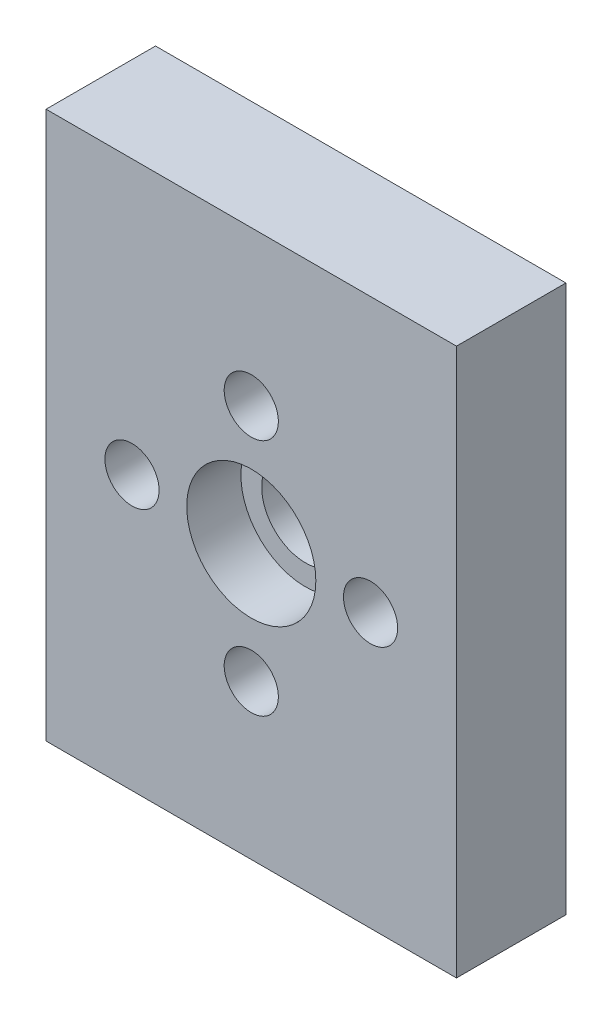
ISO-10303-21;
HEADER;
FILE_DESCRIPTION(('STEP AP214'),'2;1');
FILE_NAME('part.step','',(''),(''),'','','');
FILE_SCHEMA(('AUTOMOTIVE_DESIGN { 1 0 10303 214 1 1 1 1 }'));
ENDSEC;
DATA;
#1=APPLICATION_CONTEXT('core data for automotive mechanical design processes');
#2=APPLICATION_PROTOCOL_DEFINITION('international standard','automotive_design',2000,#1);
#3=PRODUCT_CONTEXT('',#1,'mechanical');
#4=PRODUCT('Part','Part','',(#3));
#5=PRODUCT_RELATED_PRODUCT_CATEGORY('part','',(#4));
#6=PRODUCT_DEFINITION_FORMATION('','',#4);
#7=PRODUCT_DEFINITION_CONTEXT('part definition',#1,'design');
#8=PRODUCT_DEFINITION('design','',#6,#7);
#9=PRODUCT_DEFINITION_SHAPE('','',#8);
#10=(LENGTH_UNIT() NAMED_UNIT(*) SI_UNIT(.MILLI.,.METRE.));
#11=(NAMED_UNIT(*) PLANE_ANGLE_UNIT() SI_UNIT($,.RADIAN.));
#12=(NAMED_UNIT(*) SI_UNIT($,.STERADIAN.) SOLID_ANGLE_UNIT());
#13=UNCERTAINTY_MEASURE_WITH_UNIT(LENGTH_MEASURE(1.E-05),#10,'distance_accuracy_value','');
#14=(GEOMETRIC_REPRESENTATION_CONTEXT(3) GLOBAL_UNCERTAINTY_ASSIGNED_CONTEXT((#13)) GLOBAL_UNIT_ASSIGNED_CONTEXT((#10,
#11,#12)) REPRESENTATION_CONTEXT('',''));
#15=CARTESIAN_POINT('',(0.,0.,0.));
#16=DIRECTION('',(0.,0.,1.));
#17=DIRECTION('',(1.,0.,0.));
#18=AXIS2_PLACEMENT_3D('',#15,#16,#17);
#19=CARTESIAN_POINT('',(9.525,-12.7,5.08));
#20=DIRECTION('',(-1.,0.,0.));
#21=DIRECTION('',(0.,0.,1.));
#22=AXIS2_PLACEMENT_3D('',#19,#20,#21);
#23=PLANE('',#22);
#24=DIRECTION('',(0.,1.,0.));
#25=VECTOR('',#24,1.);
#26=CARTESIAN_POINT('',(9.525,-12.7,0.));
#27=LINE('',#26,#25);
#28=CARTESIAN_POINT('',(9.525,-12.7,0.));
#29=VERTEX_POINT('',#28);
#30=CARTESIAN_POINT('',(9.525,12.7,0.));
#31=VERTEX_POINT('',#30);
#32=EDGE_CURVE('E96',#29,#31,#27,.T.);
#33=ORIENTED_EDGE('',*,*,#32,.T.);
#34=DIRECTION('',(0.,0.,-1.));
#35=VECTOR('',#34,1.);
#36=CARTESIAN_POINT('',(9.525,12.7,5.08));
#37=LINE('',#36,#35);
#38=CARTESIAN_POINT('',(9.525,12.7,5.08));
#39=VERTEX_POINT('',#38);
#40=EDGE_CURVE('E11',#39,#31,#37,.T.);
#41=ORIENTED_EDGE('',*,*,#40,.F.);
#42=DIRECTION('',(0.,1.,0.));
#43=VECTOR('',#42,1.);
#44=CARTESIAN_POINT('',(9.525,-12.7,5.08));
#45=LINE('',#44,#43);
#46=CARTESIAN_POINT('',(9.525,-12.7,5.08));
#47=VERTEX_POINT('',#46);
#48=EDGE_CURVE('E84',#47,#39,#45,.T.);
#49=ORIENTED_EDGE('',*,*,#48,.F.);
#50=DIRECTION('',(0.,0.,-1.));
#51=VECTOR('',#50,1.);
#52=CARTESIAN_POINT('',(9.525,-12.7,5.08));
#53=LINE('',#52,#51);
#54=EDGE_CURVE('E92',#47,#29,#53,.T.);
#55=ORIENTED_EDGE('',*,*,#54,.T.);
#56=EDGE_LOOP('',(#33,#41,#49,#55));
#57=FACE_BOUND('',#56,.T.);
#58=ADVANCED_FACE('F33',(#57),#23,.F.);
#59=CARTESIAN_POINT('',(-9.525,12.7,5.08));
#60=DIRECTION('',(0.,-1.,0.));
#61=DIRECTION('',(0.,0.,-1.));
#62=AXIS2_PLACEMENT_3D('',#59,#60,#61);
#63=PLANE('',#62);
#64=DIRECTION('',(-1.,0.,0.));
#65=VECTOR('',#64,1.);
#66=CARTESIAN_POINT('',(-9.525,12.7,0.));
#67=LINE('',#66,#65);
#68=CARTESIAN_POINT('',(-9.525,12.7,0.));
#69=VERTEX_POINT('',#68);
#70=EDGE_CURVE('E88',#31,#69,#67,.T.);
#71=ORIENTED_EDGE('',*,*,#70,.T.);
#72=DIRECTION('',(0.,0.,-1.));
#73=VECTOR('',#72,1.);
#74=CARTESIAN_POINT('',(-9.525,12.7,5.08));
#75=LINE('',#74,#73);
#76=CARTESIAN_POINT('',(-9.525,12.7,5.08));
#77=VERTEX_POINT('',#76);
#78=EDGE_CURVE('E41',#77,#69,#75,.T.);
#79=ORIENTED_EDGE('',*,*,#78,.F.);
#80=DIRECTION('',(-1.,0.,0.));
#81=VECTOR('',#80,1.);
#82=CARTESIAN_POINT('',(-9.525,12.7,5.08));
#83=LINE('',#82,#81);
#84=EDGE_CURVE('E79',#39,#77,#83,.T.);
#85=ORIENTED_EDGE('',*,*,#84,.F.);
#86=ORIENTED_EDGE('',*,*,#40,.T.);
#87=EDGE_LOOP('',(#71,#79,#85,#86));
#88=FACE_BOUND('',#87,.T.);
#89=ADVANCED_FACE('F87',(#88),#63,.F.);
#90=CARTESIAN_POINT('',(-9.525,-12.7,5.08));
#91=DIRECTION('',(1.,0.,0.));
#92=DIRECTION('',(0.,0.,-1.));
#93=AXIS2_PLACEMENT_3D('',#90,#91,#92);
#94=PLANE('',#93);
#95=DIRECTION('',(0.,-1.,0.));
#96=VECTOR('',#95,1.);
#97=CARTESIAN_POINT('',(-9.525,-12.7,0.));
#98=LINE('',#97,#96);
#99=CARTESIAN_POINT('',(-9.525,-12.7,0.));
#100=VERTEX_POINT('',#99);
#101=EDGE_CURVE('E66',#69,#100,#98,.T.);
#102=ORIENTED_EDGE('',*,*,#101,.T.);
#103=DIRECTION('',(0.,0.,-1.));
#104=VECTOR('',#103,1.);
#105=CARTESIAN_POINT('',(-9.525,-12.7,5.08));
#106=LINE('',#105,#104);
#107=CARTESIAN_POINT('',(-9.525,-12.7,5.08));
#108=VERTEX_POINT('',#107);
#109=EDGE_CURVE('E89',#108,#100,#106,.T.);
#110=ORIENTED_EDGE('',*,*,#109,.F.);
#111=DIRECTION('',(0.,-1.,0.));
#112=VECTOR('',#111,1.);
#113=CARTESIAN_POINT('',(-9.525,-12.7,5.08));
#114=LINE('',#113,#112);
#115=EDGE_CURVE('E82',#77,#108,#114,.T.);
#116=ORIENTED_EDGE('',*,*,#115,.F.);
#117=ORIENTED_EDGE('',*,*,#78,.T.);
#118=EDGE_LOOP('',(#102,#110,#116,#117));
#119=FACE_BOUND('',#118,.T.);
#120=ADVANCED_FACE('F90',(#119),#94,.F.);
#121=CARTESIAN_POINT('',(-9.525,-12.7,5.08));
#122=DIRECTION('',(0.,1.,0.));
#123=DIRECTION('',(0.,0.,1.));
#124=AXIS2_PLACEMENT_3D('',#121,#122,#123);
#125=PLANE('',#124);
#126=DIRECTION('',(1.,0.,0.));
#127=VECTOR('',#126,1.);
#128=CARTESIAN_POINT('',(-9.525,-12.7,0.));
#129=LINE('',#128,#127);
#130=EDGE_CURVE('E72',#100,#29,#129,.T.);
#131=ORIENTED_EDGE('',*,*,#130,.T.);
#132=ORIENTED_EDGE('',*,*,#54,.F.);
#133=DIRECTION('',(1.,0.,0.));
#134=VECTOR('',#133,1.);
#135=CARTESIAN_POINT('',(-9.525,-12.7,5.08));
#136=LINE('',#135,#134);
#137=EDGE_CURVE('E49',#108,#47,#136,.T.);
#138=ORIENTED_EDGE('',*,*,#137,.F.);
#139=ORIENTED_EDGE('',*,*,#109,.T.);
#140=EDGE_LOOP('',(#131,#132,#138,#139));
#141=FACE_BOUND('',#140,.T.);
#142=ADVANCED_FACE('F104',(#141),#125,.F.);
#143=CARTESIAN_POINT('',(0.,0.,5.08));
#144=DIRECTION('',(0.,0.,-1.));
#145=DIRECTION('',(-1.,0.,0.));
#146=AXIS2_PLACEMENT_3D('',#143,#144,#145);
#147=PLANE('',#146);
#148=CARTESIAN_POINT('',(-5.53719999999984,-1.57376689458033E-13,5.08));
#149=DIRECTION('',(0.,0.,1.));
#150=DIRECTION('',(1.,0.,0.));
#151=AXIS2_PLACEMENT_3D('',#148,#149,#150);
#152=CIRCLE('',#151,1.25730000000025);
#153=CARTESIAN_POINT('',(-4.27989999999959,-1.57376689458033E-13,5.08));
#154=VERTEX_POINT('',#153);
#155=EDGE_CURVE('E140',#154,#154,#152,.T.);
#156=ORIENTED_EDGE('',*,*,#155,.F.);
#157=EDGE_LOOP('',(#156));
#158=FACE_BOUND('',#157,.T.);
#159=CARTESIAN_POINT('',(3.13397156064818E-13,-5.5372,5.08));
#160=DIRECTION('',(0.,0.,1.));
#161=DIRECTION('',(1.,0.,0.));
#162=AXIS2_PLACEMENT_3D('',#159,#160,#161);
#163=CIRCLE('',#162,1.25730000000034);
#164=CARTESIAN_POINT('',(1.25730000000065,-5.5372,5.08));
#165=VERTEX_POINT('',#164);
#166=EDGE_CURVE('E134',#165,#165,#163,.T.);
#167=ORIENTED_EDGE('',*,*,#166,.F.);
#168=EDGE_LOOP('',(#167));
#169=FACE_BOUND('',#168,.T.);
#170=CARTESIAN_POINT('',(5.53720000000016,1.56698578032409E-13,5.08));
#171=DIRECTION('',(0.,0.,1.));
#172=DIRECTION('',(1.,0.,0.));
#173=AXIS2_PLACEMENT_3D('',#170,#171,#172);
#174=CIRCLE('',#173,1.25730000000012);
#175=CARTESIAN_POINT('',(6.79450000000028,1.56698578032409E-13,5.08));
#176=VERTEX_POINT('',#175);
#177=EDGE_CURVE('E128',#176,#176,#174,.T.);
#178=ORIENTED_EDGE('',*,*,#177,.F.);
#179=EDGE_LOOP('',(#178));
#180=FACE_BOUND('',#179,.T.);
#181=CARTESIAN_POINT('',(0.,5.5372,5.08));
#182=DIRECTION('',(0.,0.,1.));
#183=DIRECTION('',(1.,0.,0.));
#184=AXIS2_PLACEMENT_3D('',#181,#182,#183);
#185=CIRCLE('',#184,1.2573);
#186=CARTESIAN_POINT('',(1.2573,5.5372,5.08));
#187=VERTEX_POINT('',#186);
#188=EDGE_CURVE('E122',#187,#187,#185,.T.);
#189=ORIENTED_EDGE('',*,*,#188,.F.);
#190=EDGE_LOOP('',(#189));
#191=FACE_BOUND('',#190,.T.);
#192=CARTESIAN_POINT('',(0.,0.,5.08));
#193=DIRECTION('',(0.,0.,1.));
#194=DIRECTION('',(1.,0.,0.));
#195=AXIS2_PLACEMENT_3D('',#192,#193,#194);
#196=CIRCLE('',#195,2.9972);
#197=CARTESIAN_POINT('',(2.9972,0.,5.08));
#198=VERTEX_POINT('',#197);
#199=EDGE_CURVE('E110',#198,#198,#196,.T.);
#200=ORIENTED_EDGE('',*,*,#199,.F.);
#201=EDGE_LOOP('',(#200));
#202=FACE_BOUND('',#201,.T.);
#203=ORIENTED_EDGE('',*,*,#48,.T.);
#204=ORIENTED_EDGE('',*,*,#84,.T.);
#205=ORIENTED_EDGE('',*,*,#115,.T.);
#206=ORIENTED_EDGE('',*,*,#137,.T.);
#207=EDGE_LOOP('',(#203,#204,#205,#206));
#208=FACE_BOUND('',#207,.T.);
#209=ADVANCED_FACE('F80',(#158,#169,#180,#191,#202,#208),#147,.F.);
#210=CARTESIAN_POINT('',(0.,0.,0.));
#211=DIRECTION('',(0.,0.,-1.));
#212=DIRECTION('',(-1.,0.,0.));
#213=AXIS2_PLACEMENT_3D('',#210,#211,#212);
#214=PLANE('',#213);
#215=CARTESIAN_POINT('',(-5.53719999999984,-1.57376689458033E-13,0.));
#216=DIRECTION('',(0.,0.,1.));
#217=DIRECTION('',(1.,0.,0.));
#218=AXIS2_PLACEMENT_3D('',#215,#216,#217);
#219=CIRCLE('',#218,1.25730000000025);
#220=CARTESIAN_POINT('',(-4.27989999999959,-1.57376689458033E-13,0.));
#221=VERTEX_POINT('',#220);
#222=EDGE_CURVE('E137',#221,#221,#219,.T.);
#223=ORIENTED_EDGE('',*,*,#222,.T.);
#224=EDGE_LOOP('',(#223));
#225=FACE_BOUND('',#224,.T.);
#226=CARTESIAN_POINT('',(3.13397156064818E-13,-5.5372,0.));
#227=DIRECTION('',(0.,0.,1.));
#228=DIRECTION('',(1.,0.,0.));
#229=AXIS2_PLACEMENT_3D('',#226,#227,#228);
#230=CIRCLE('',#229,1.25730000000034);
#231=CARTESIAN_POINT('',(1.25730000000065,-5.5372,0.));
#232=VERTEX_POINT('',#231);
#233=EDGE_CURVE('E131',#232,#232,#230,.T.);
#234=ORIENTED_EDGE('',*,*,#233,.T.);
#235=EDGE_LOOP('',(#234));
#236=FACE_BOUND('',#235,.T.);
#237=CARTESIAN_POINT('',(5.53720000000016,1.56698578032409E-13,0.));
#238=DIRECTION('',(0.,0.,1.));
#239=DIRECTION('',(1.,0.,0.));
#240=AXIS2_PLACEMENT_3D('',#237,#238,#239);
#241=CIRCLE('',#240,1.25730000000012);
#242=CARTESIAN_POINT('',(6.79450000000028,1.56698578032409E-13,0.));
#243=VERTEX_POINT('',#242);
#244=EDGE_CURVE('E125',#243,#243,#241,.T.);
#245=ORIENTED_EDGE('',*,*,#244,.T.);
#246=EDGE_LOOP('',(#245));
#247=FACE_BOUND('',#246,.T.);
#248=CARTESIAN_POINT('',(0.,5.5372,0.));
#249=DIRECTION('',(0.,0.,1.));
#250=DIRECTION('',(1.,0.,0.));
#251=AXIS2_PLACEMENT_3D('',#248,#249,#250);
#252=CIRCLE('',#251,1.2573);
#253=CARTESIAN_POINT('',(1.2573,5.5372,0.));
#254=VERTEX_POINT('',#253);
#255=EDGE_CURVE('E119',#254,#254,#252,.T.);
#256=ORIENTED_EDGE('',*,*,#255,.T.);
#257=EDGE_LOOP('',(#256));
#258=FACE_BOUND('',#257,.T.);
#259=CARTESIAN_POINT('',(0.,0.,0.));
#260=DIRECTION('',(0.,0.,1.));
#261=DIRECTION('',(1.,0.,0.));
#262=AXIS2_PLACEMENT_3D('',#259,#260,#261);
#263=CIRCLE('',#262,2.032);
#264=CARTESIAN_POINT('',(2.032,0.,0.));
#265=VERTEX_POINT('',#264);
#266=EDGE_CURVE('E113',#265,#265,#263,.T.);
#267=ORIENTED_EDGE('',*,*,#266,.T.);
#268=EDGE_LOOP('',(#267));
#269=FACE_BOUND('',#268,.T.);
#270=ORIENTED_EDGE('',*,*,#32,.F.);
#271=ORIENTED_EDGE('',*,*,#130,.F.);
#272=ORIENTED_EDGE('',*,*,#101,.F.);
#273=ORIENTED_EDGE('',*,*,#70,.F.);
#274=EDGE_LOOP('',(#270,#271,#272,#273));
#275=FACE_BOUND('',#274,.T.);
#276=ADVANCED_FACE('F107',(#225,#236,#247,#258,#269,#275),#214,.T.);
#277=CARTESIAN_POINT('',(0.,0.,2.5654));
#278=DIRECTION('',(0.,0.,1.));
#279=DIRECTION('',(1.,0.,0.));
#280=AXIS2_PLACEMENT_3D('',#277,#278,#279);
#281=CYLINDRICAL_SURFACE('',#280,2.9972);
#282=CARTESIAN_POINT('',(0.,0.,2.5654));
#283=DIRECTION('',(0.,0.,1.));
#284=DIRECTION('',(1.,0.,0.));
#285=AXIS2_PLACEMENT_3D('',#282,#283,#284);
#286=CIRCLE('',#285,2.9972);
#287=CARTESIAN_POINT('',(2.9972,0.,2.5654));
#288=VERTEX_POINT('',#287);
#289=EDGE_CURVE('E99',#288,#288,#286,.T.);
#290=ORIENTED_EDGE('',*,*,#289,.F.);
#291=EDGE_LOOP('',(#290));
#292=FACE_BOUND('',#291,.T.);
#293=ORIENTED_EDGE('',*,*,#199,.T.);
#294=EDGE_LOOP('',(#293));
#295=FACE_BOUND('',#294,.T.);
#296=ADVANCED_FACE('F166',(#292,#295),#281,.F.);
#297=CARTESIAN_POINT('',(0.,0.,2.5654));
#298=DIRECTION('',(0.,0.,1.));
#299=DIRECTION('',(1.,0.,0.));
#300=AXIS2_PLACEMENT_3D('',#297,#298,#299);
#301=PLANE('',#300);
#302=CARTESIAN_POINT('',(0.,0.,2.5654));
#303=DIRECTION('',(0.,0.,1.));
#304=DIRECTION('',(1.,0.,0.));
#305=AXIS2_PLACEMENT_3D('',#302,#303,#304);
#306=CIRCLE('',#305,2.032);
#307=CARTESIAN_POINT('',(2.032,0.,2.5654));
#308=VERTEX_POINT('',#307);
#309=EDGE_CURVE('E116',#308,#308,#306,.T.);
#310=ORIENTED_EDGE('',*,*,#309,.F.);
#311=EDGE_LOOP('',(#310));
#312=FACE_BOUND('',#311,.T.);
#313=ORIENTED_EDGE('',*,*,#289,.T.);
#314=EDGE_LOOP('',(#313));
#315=FACE_BOUND('',#314,.T.);
#316=ADVANCED_FACE('F168',(#312,#315),#301,.T.);
#317=CARTESIAN_POINT('',(0.,0.,0.));
#318=DIRECTION('',(0.,0.,1.));
#319=DIRECTION('',(1.,0.,0.));
#320=AXIS2_PLACEMENT_3D('',#317,#318,#319);
#321=CYLINDRICAL_SURFACE('',#320,2.032);
#322=ORIENTED_EDGE('',*,*,#266,.F.);
#323=EDGE_LOOP('',(#322));
#324=FACE_BOUND('',#323,.T.);
#325=ORIENTED_EDGE('',*,*,#309,.T.);
#326=EDGE_LOOP('',(#325));
#327=FACE_BOUND('',#326,.T.);
#328=ADVANCED_FACE('F175',(#324,#327),#321,.F.);
#329=CARTESIAN_POINT('',(0.,5.5372,0.));
#330=DIRECTION('',(0.,0.,1.));
#331=DIRECTION('',(1.,0.,0.));
#332=AXIS2_PLACEMENT_3D('',#329,#330,#331);
#333=CYLINDRICAL_SURFACE('',#332,1.2573);
#334=ORIENTED_EDGE('',*,*,#255,.F.);
#335=EDGE_LOOP('',(#334));
#336=FACE_BOUND('',#335,.T.);
#337=ORIENTED_EDGE('',*,*,#188,.T.);
#338=EDGE_LOOP('',(#337));
#339=FACE_BOUND('',#338,.T.);
#340=ADVANCED_FACE('F209',(#336,#339),#333,.F.);
#341=CARTESIAN_POINT('',(5.53720000000016,1.56698578032409E-13,0.));
#342=DIRECTION('',(0.,0.,1.));
#343=DIRECTION('',(1.,0.,0.));
#344=AXIS2_PLACEMENT_3D('',#341,#342,#343);
#345=CYLINDRICAL_SURFACE('',#344,1.25730000000012);
#346=ORIENTED_EDGE('',*,*,#244,.F.);
#347=EDGE_LOOP('',(#346));
#348=FACE_BOUND('',#347,.T.);
#349=ORIENTED_EDGE('',*,*,#177,.T.);
#350=EDGE_LOOP('',(#349));
#351=FACE_BOUND('',#350,.T.);
#352=ADVANCED_FACE('F214',(#348,#351),#345,.F.);
#353=CARTESIAN_POINT('',(3.13397156064818E-13,-5.5372,0.));
#354=DIRECTION('',(0.,0.,1.));
#355=DIRECTION('',(1.,0.,0.));
#356=AXIS2_PLACEMENT_3D('',#353,#354,#355);
#357=CYLINDRICAL_SURFACE('',#356,1.25730000000034);
#358=ORIENTED_EDGE('',*,*,#233,.F.);
#359=EDGE_LOOP('',(#358));
#360=FACE_BOUND('',#359,.T.);
#361=ORIENTED_EDGE('',*,*,#166,.T.);
#362=EDGE_LOOP('',(#361));
#363=FACE_BOUND('',#362,.T.);
#364=ADVANCED_FACE('F151',(#360,#363),#357,.F.);
#365=CARTESIAN_POINT('',(-5.53719999999984,-1.57376689458033E-13,0.));
#366=DIRECTION('',(0.,0.,1.));
#367=DIRECTION('',(1.,0.,0.));
#368=AXIS2_PLACEMENT_3D('',#365,#366,#367);
#369=CYLINDRICAL_SURFACE('',#368,1.25730000000025);
#370=ORIENTED_EDGE('',*,*,#222,.F.);
#371=EDGE_LOOP('',(#370));
#372=FACE_BOUND('',#371,.T.);
#373=ORIENTED_EDGE('',*,*,#155,.T.);
#374=EDGE_LOOP('',(#373));
#375=FACE_BOUND('',#374,.T.);
#376=ADVANCED_FACE('F148',(#372,#375),#369,.F.);
#377=CLOSED_SHELL('',(#58,#89,#120,#142,#209,#276,#296,#316,#328,#340,#352,#364,#376));
#378=MANIFOLD_SOLID_BREP('B2',#377);
#379=ADVANCED_BREP_SHAPE_REPRESENTATION('',(#18,#378),#14);
#380=SHAPE_DEFINITION_REPRESENTATION(#9,#379);
ENDSEC;
END-ISO-10303-21;
